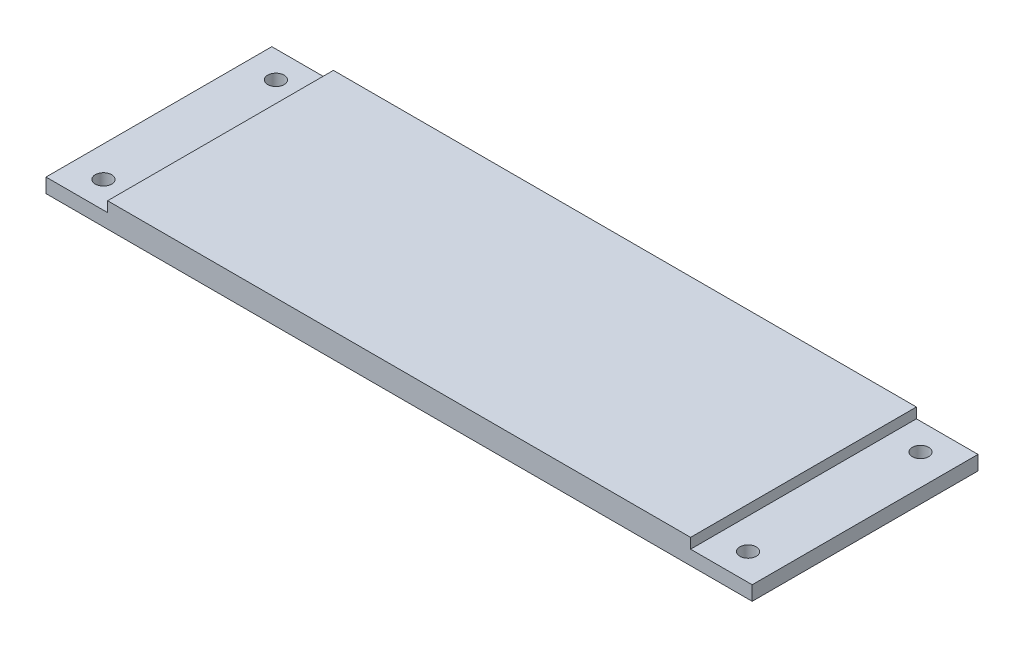
ISO-10303-21;
HEADER;
FILE_DESCRIPTION(('STEP AP214'),'2;1');
FILE_NAME('part.step','',(''),(''),'','','');
FILE_SCHEMA(('AUTOMOTIVE_DESIGN { 1 0 10303 214 1 1 1 1 }'));
ENDSEC;
DATA;
#1=APPLICATION_CONTEXT('core data for automotive mechanical design processes');
#2=APPLICATION_PROTOCOL_DEFINITION('international standard','automotive_design',2000,#1);
#3=PRODUCT_CONTEXT('',#1,'mechanical');
#4=PRODUCT('Part','Part','',(#3));
#5=PRODUCT_RELATED_PRODUCT_CATEGORY('part','',(#4));
#6=PRODUCT_DEFINITION_FORMATION('','',#4);
#7=PRODUCT_DEFINITION_CONTEXT('part definition',#1,'design');
#8=PRODUCT_DEFINITION('design','',#6,#7);
#9=PRODUCT_DEFINITION_SHAPE('','',#8);
#10=(LENGTH_UNIT() NAMED_UNIT(*) SI_UNIT(.MILLI.,.METRE.));
#11=(NAMED_UNIT(*) PLANE_ANGLE_UNIT() SI_UNIT($,.RADIAN.));
#12=(NAMED_UNIT(*) SI_UNIT($,.STERADIAN.) SOLID_ANGLE_UNIT());
#13=UNCERTAINTY_MEASURE_WITH_UNIT(LENGTH_MEASURE(1.E-05),#10,'distance_accuracy_value','');
#14=(GEOMETRIC_REPRESENTATION_CONTEXT(3) GLOBAL_UNCERTAINTY_ASSIGNED_CONTEXT((#13)) GLOBAL_UNIT_ASSIGNED_CONTEXT((#10,
#11,#12)) REPRESENTATION_CONTEXT('',''));
#15=CARTESIAN_POINT('',(0.,0.,0.));
#16=DIRECTION('',(0.,0.,1.));
#17=DIRECTION('',(1.,0.,0.));
#18=AXIS2_PLACEMENT_3D('',#15,#16,#17);
#19=CARTESIAN_POINT('',(0.,3.5,0.));
#20=DIRECTION('',(0.,1.,0.));
#21=DIRECTION('',(0.,0.,1.));
#22=AXIS2_PLACEMENT_3D('',#19,#20,#21);
#23=PLANE('',#22);
#24=DIRECTION('',(0.,0.,1.));
#25=VECTOR('',#24,1.);
#26=CARTESIAN_POINT('',(-71.,3.5,-27.5));
#27=LINE('',#26,#25);
#28=CARTESIAN_POINT('',(-71.,3.5,-27.5));
#29=VERTEX_POINT('',#28);
#30=CARTESIAN_POINT('',(-71.,3.5,27.5));
#31=VERTEX_POINT('',#30);
#32=EDGE_CURVE('E50',#29,#31,#27,.T.);
#33=ORIENTED_EDGE('',*,*,#32,.F.);
#34=DIRECTION('',(-1.,0.,0.));
#35=VECTOR('',#34,1.);
#36=CARTESIAN_POINT('',(-86.,3.5,-27.5));
#37=LINE('',#36,#35);
#38=CARTESIAN_POINT('',(-86.,3.5,-27.5));
#39=VERTEX_POINT('',#38);
#40=EDGE_CURVE('E144',#29,#39,#37,.T.);
#41=ORIENTED_EDGE('',*,*,#40,.T.);
#42=DIRECTION('',(0.,0.,1.));
#43=VECTOR('',#42,1.);
#44=CARTESIAN_POINT('',(-86.,3.5,-27.5));
#45=LINE('',#44,#43);
#46=CARTESIAN_POINT('',(-86.,3.5,27.5));
#47=VERTEX_POINT('',#46);
#48=EDGE_CURVE('E178',#39,#47,#45,.T.);
#49=ORIENTED_EDGE('',*,*,#48,.T.);
#50=DIRECTION('',(1.,0.,0.));
#51=VECTOR('',#50,1.);
#52=CARTESIAN_POINT('',(-86.,3.5,27.5));
#53=LINE('',#52,#51);
#54=EDGE_CURVE('E163',#47,#31,#53,.T.);
#55=ORIENTED_EDGE('',*,*,#54,.T.);
#56=EDGE_LOOP('',(#33,#41,#49,#55));
#57=FACE_BOUND('',#56,.T.);
#58=CARTESIAN_POINT('',(-78.5,3.5,-21.));
#59=DIRECTION('',(0.,1.,0.));
#60=DIRECTION('',(0.,0.,1.));
#61=AXIS2_PLACEMENT_3D('',#58,#59,#60);
#62=CIRCLE('',#61,2.);
#63=CARTESIAN_POINT('',(-78.5,3.5,-19.));
#64=VERTEX_POINT('',#63);
#65=EDGE_CURVE('E190',#64,#64,#62,.T.);
#66=ORIENTED_EDGE('',*,*,#65,.F.);
#67=EDGE_LOOP('',(#66));
#68=FACE_BOUND('',#67,.T.);
#69=CARTESIAN_POINT('',(-78.5,3.5,21.));
#70=DIRECTION('',(0.,1.,0.));
#71=DIRECTION('',(0.,0.,1.));
#72=AXIS2_PLACEMENT_3D('',#69,#70,#71);
#73=CIRCLE('',#72,2.);
#74=CARTESIAN_POINT('',(-78.5,3.5,23.));
#75=VERTEX_POINT('',#74);
#76=EDGE_CURVE('E186',#75,#75,#73,.T.);
#77=ORIENTED_EDGE('',*,*,#76,.F.);
#78=EDGE_LOOP('',(#77));
#79=FACE_BOUND('',#78,.T.);
#80=ADVANCED_FACE('F33',(#57,#68,#79),#23,.T.);
#81=CARTESIAN_POINT('',(-86.,3.5,-27.5));
#82=DIRECTION('',(1.,0.,0.));
#83=DIRECTION('',(0.,0.,-1.));
#84=AXIS2_PLACEMENT_3D('',#81,#82,#83);
#85=PLANE('',#84);
#86=DIRECTION('',(0.,0.,1.));
#87=VECTOR('',#86,1.);
#88=CARTESIAN_POINT('',(-86.,0.,-27.5));
#89=LINE('',#88,#87);
#90=CARTESIAN_POINT('',(-86.,0.,-27.5));
#91=VERTEX_POINT('',#90);
#92=CARTESIAN_POINT('',(-86.,0.,27.5));
#93=VERTEX_POINT('',#92);
#94=EDGE_CURVE('E174',#91,#93,#89,.T.);
#95=ORIENTED_EDGE('',*,*,#94,.T.);
#96=DIRECTION('',(0.,-1.,0.));
#97=VECTOR('',#96,1.);
#98=CARTESIAN_POINT('',(-86.,3.5,27.5));
#99=LINE('',#98,#97);
#100=EDGE_CURVE('E11',#47,#93,#99,.T.);
#101=ORIENTED_EDGE('',*,*,#100,.F.);
#102=ORIENTED_EDGE('',*,*,#48,.F.);
#103=DIRECTION('',(0.,-1.,0.));
#104=VECTOR('',#103,1.);
#105=CARTESIAN_POINT('',(-86.,3.5,-27.5));
#106=LINE('',#105,#104);
#107=EDGE_CURVE('E158',#39,#91,#106,.T.);
#108=ORIENTED_EDGE('',*,*,#107,.T.);
#109=EDGE_LOOP('',(#95,#101,#102,#108));
#110=FACE_BOUND('',#109,.T.);
#111=ADVANCED_FACE('F35',(#110),#85,.F.);
#112=CARTESIAN_POINT('',(-86.,3.5,27.5));
#113=DIRECTION('',(0.,0.,-1.));
#114=DIRECTION('',(-1.,0.,0.));
#115=AXIS2_PLACEMENT_3D('',#112,#113,#114);
#116=PLANE('',#115);
#117=DIRECTION('',(1.,0.,0.));
#118=VECTOR('',#117,1.);
#119=CARTESIAN_POINT('',(-86.,0.,27.5));
#120=LINE('',#119,#118);
#121=CARTESIAN_POINT('',(86.,0.,27.5));
#122=VERTEX_POINT('',#121);
#123=EDGE_CURVE('E203',#93,#122,#120,.T.);
#124=ORIENTED_EDGE('',*,*,#123,.T.);
#125=DIRECTION('',(0.,-1.,0.));
#126=VECTOR('',#125,1.);
#127=CARTESIAN_POINT('',(86.,3.5,27.5));
#128=LINE('',#127,#126);
#129=CARTESIAN_POINT('',(86.,3.5,27.5));
#130=VERTEX_POINT('',#129);
#131=EDGE_CURVE('E42',#130,#122,#128,.T.);
#132=ORIENTED_EDGE('',*,*,#131,.F.);
#133=CARTESIAN_POINT('',(71.,3.5,27.5));
#134=VERTEX_POINT('',#133);
#135=EDGE_CURVE('E167',#134,#130,#53,.T.);
#136=ORIENTED_EDGE('',*,*,#135,.F.);
#137=DIRECTION('',(0.,-1.,0.));
#138=VECTOR('',#137,1.);
#139=CARTESIAN_POINT('',(71.,6.,27.5));
#140=LINE('',#139,#138);
#141=CARTESIAN_POINT('',(71.,6.,27.5));
#142=VERTEX_POINT('',#141);
#143=EDGE_CURVE('E106',#142,#134,#140,.T.);
#144=ORIENTED_EDGE('',*,*,#143,.F.);
#145=DIRECTION('',(1.,0.,0.));
#146=VECTOR('',#145,1.);
#147=CARTESIAN_POINT('',(-71.,6.,27.5));
#148=LINE('',#147,#146);
#149=CARTESIAN_POINT('',(-71.,6.,27.5));
#150=VERTEX_POINT('',#149);
#151=EDGE_CURVE('E100',#150,#142,#148,.T.);
#152=ORIENTED_EDGE('',*,*,#151,.F.);
#153=DIRECTION('',(0.,-1.,0.));
#154=VECTOR('',#153,1.);
#155=CARTESIAN_POINT('',(-71.,6.,27.5));
#156=LINE('',#155,#154);
#157=EDGE_CURVE('E104',#150,#31,#156,.T.);
#158=ORIENTED_EDGE('',*,*,#157,.T.);
#159=ORIENTED_EDGE('',*,*,#54,.F.);
#160=ORIENTED_EDGE('',*,*,#100,.T.);
#161=EDGE_LOOP('',(#124,#132,#136,#144,#152,#158,#159,#160));
#162=FACE_BOUND('',#161,.T.);
#163=ADVANCED_FACE('F102',(#162),#116,.F.);
#164=CARTESIAN_POINT('',(86.,3.5,-27.5));
#165=DIRECTION('',(-1.,0.,0.));
#166=DIRECTION('',(0.,0.,1.));
#167=AXIS2_PLACEMENT_3D('',#164,#165,#166);
#168=PLANE('',#167);
#169=DIRECTION('',(0.,0.,-1.));
#170=VECTOR('',#169,1.);
#171=CARTESIAN_POINT('',(86.,0.,-27.5));
#172=LINE('',#171,#170);
#173=CARTESIAN_POINT('',(86.,0.,-27.5));
#174=VERTEX_POINT('',#173);
#175=EDGE_CURVE('E202',#122,#174,#172,.T.);
#176=ORIENTED_EDGE('',*,*,#175,.T.);
#177=DIRECTION('',(0.,-1.,0.));
#178=VECTOR('',#177,1.);
#179=CARTESIAN_POINT('',(86.,3.5,-27.5));
#180=LINE('',#179,#178);
#181=CARTESIAN_POINT('',(86.,3.5,-27.5));
#182=VERTEX_POINT('',#181);
#183=EDGE_CURVE('E196',#182,#174,#180,.T.);
#184=ORIENTED_EDGE('',*,*,#183,.F.);
#185=DIRECTION('',(0.,0.,-1.));
#186=VECTOR('',#185,1.);
#187=CARTESIAN_POINT('',(86.,3.5,-27.5));
#188=LINE('',#187,#186);
#189=EDGE_CURVE('E162',#130,#182,#188,.T.);
#190=ORIENTED_EDGE('',*,*,#189,.F.);
#191=ORIENTED_EDGE('',*,*,#131,.T.);
#192=EDGE_LOOP('',(#176,#184,#190,#191));
#193=FACE_BOUND('',#192,.T.);
#194=ADVANCED_FACE('F234',(#193),#168,.F.);
#195=CARTESIAN_POINT('',(-86.,3.5,-27.5));
#196=DIRECTION('',(0.,0.,1.));
#197=DIRECTION('',(1.,0.,0.));
#198=AXIS2_PLACEMENT_3D('',#195,#196,#197);
#199=PLANE('',#198);
#200=DIRECTION('',(-1.,0.,0.));
#201=VECTOR('',#200,1.);
#202=CARTESIAN_POINT('',(-86.,0.,-27.5));
#203=LINE('',#202,#201);
#204=EDGE_CURVE('E200',#174,#91,#203,.T.);
#205=ORIENTED_EDGE('',*,*,#204,.T.);
#206=ORIENTED_EDGE('',*,*,#107,.F.);
#207=ORIENTED_EDGE('',*,*,#40,.F.);
#208=DIRECTION('',(0.,-1.,0.));
#209=VECTOR('',#208,1.);
#210=CARTESIAN_POINT('',(-71.,6.,-27.5));
#211=LINE('',#210,#209);
#212=CARTESIAN_POINT('',(-71.,6.,-27.5));
#213=VERTEX_POINT('',#212);
#214=EDGE_CURVE('E134',#213,#29,#211,.T.);
#215=ORIENTED_EDGE('',*,*,#214,.F.);
#216=DIRECTION('',(-1.,0.,0.));
#217=VECTOR('',#216,1.);
#218=CARTESIAN_POINT('',(-71.,6.,-27.5));
#219=LINE('',#218,#217);
#220=CARTESIAN_POINT('',(71.,6.,-27.5));
#221=VERTEX_POINT('',#220);
#222=EDGE_CURVE('E115',#221,#213,#219,.T.);
#223=ORIENTED_EDGE('',*,*,#222,.F.);
#224=DIRECTION('',(0.,-1.,0.));
#225=VECTOR('',#224,1.);
#226=CARTESIAN_POINT('',(71.,6.,-27.5));
#227=LINE('',#226,#225);
#228=CARTESIAN_POINT('',(71.,3.5,-27.5));
#229=VERTEX_POINT('',#228);
#230=EDGE_CURVE('E126',#221,#229,#227,.T.);
#231=ORIENTED_EDGE('',*,*,#230,.T.);
#232=EDGE_CURVE('E161',#182,#229,#37,.T.);
#233=ORIENTED_EDGE('',*,*,#232,.F.);
#234=ORIENTED_EDGE('',*,*,#183,.T.);
#235=EDGE_LOOP('',(#205,#206,#207,#215,#223,#231,#233,#234));
#236=FACE_BOUND('',#235,.T.);
#237=ADVANCED_FACE('F155',(#236),#199,.F.);
#238=DIRECTION('',(0.,0.,-1.));
#239=VECTOR('',#238,1.);
#240=CARTESIAN_POINT('',(71.,3.5,-27.5));
#241=LINE('',#240,#239);
#242=EDGE_CURVE('E58',#134,#229,#241,.T.);
#243=ORIENTED_EDGE('',*,*,#242,.F.);
#244=ORIENTED_EDGE('',*,*,#135,.T.);
#245=ORIENTED_EDGE('',*,*,#189,.T.);
#246=ORIENTED_EDGE('',*,*,#232,.T.);
#247=EDGE_LOOP('',(#243,#244,#245,#246));
#248=FACE_BOUND('',#247,.T.);
#249=CARTESIAN_POINT('',(78.5,3.5,-21.));
#250=DIRECTION('',(0.,1.,0.));
#251=DIRECTION('',(0.,0.,-1.));
#252=AXIS2_PLACEMENT_3D('',#249,#250,#251);
#253=CIRCLE('',#252,2.);
#254=CARTESIAN_POINT('',(78.5,3.5,-23.));
#255=VERTEX_POINT('',#254);
#256=EDGE_CURVE('E121',#255,#255,#253,.T.);
#257=ORIENTED_EDGE('',*,*,#256,.F.);
#258=EDGE_LOOP('',(#257));
#259=FACE_BOUND('',#258,.T.);
#260=CARTESIAN_POINT('',(78.5,3.5,20.9999999999999));
#261=DIRECTION('',(0.,1.,0.));
#262=DIRECTION('',(0.,0.,-1.));
#263=AXIS2_PLACEMENT_3D('',#260,#261,#262);
#264=CIRCLE('',#263,2.);
#265=CARTESIAN_POINT('',(78.5,3.5,18.9999999999999));
#266=VERTEX_POINT('',#265);
#267=EDGE_CURVE('E182',#266,#266,#264,.T.);
#268=ORIENTED_EDGE('',*,*,#267,.F.);
#269=EDGE_LOOP('',(#268));
#270=FACE_BOUND('',#269,.T.);
#271=ADVANCED_FACE('F224',(#248,#259,#270),#23,.T.);
#272=CARTESIAN_POINT('',(0.,0.,0.));
#273=DIRECTION('',(0.,1.,0.));
#274=DIRECTION('',(0.,0.,1.));
#275=AXIS2_PLACEMENT_3D('',#272,#273,#274);
#276=PLANE('',#275);
#277=CARTESIAN_POINT('',(78.5,0.,-21.));
#278=DIRECTION('',(0.,1.,0.));
#279=DIRECTION('',(0.,0.,1.));
#280=AXIS2_PLACEMENT_3D('',#277,#278,#279);
#281=CIRCLE('',#280,2.);
#282=CARTESIAN_POINT('',(78.5,0.,-19.));
#283=VERTEX_POINT('',#282);
#284=EDGE_CURVE('E124',#283,#283,#281,.T.);
#285=ORIENTED_EDGE('',*,*,#284,.T.);
#286=EDGE_LOOP('',(#285));
#287=FACE_BOUND('',#286,.T.);
#288=CARTESIAN_POINT('',(78.5,0.,20.9999999999999));
#289=DIRECTION('',(0.,1.,0.));
#290=DIRECTION('',(0.,0.,1.));
#291=AXIS2_PLACEMENT_3D('',#288,#289,#290);
#292=CIRCLE('',#291,2.);
#293=CARTESIAN_POINT('',(78.5,0.,22.9999999999999));
#294=VERTEX_POINT('',#293);
#295=EDGE_CURVE('E183',#294,#294,#292,.T.);
#296=ORIENTED_EDGE('',*,*,#295,.T.);
#297=EDGE_LOOP('',(#296));
#298=FACE_BOUND('',#297,.T.);
#299=CARTESIAN_POINT('',(-78.5,0.,21.));
#300=DIRECTION('',(0.,1.,0.));
#301=DIRECTION('',(0.,0.,1.));
#302=AXIS2_PLACEMENT_3D('',#299,#300,#301);
#303=CIRCLE('',#302,2.);
#304=CARTESIAN_POINT('',(-78.5,0.,23.));
#305=VERTEX_POINT('',#304);
#306=EDGE_CURVE('E187',#305,#305,#303,.T.);
#307=ORIENTED_EDGE('',*,*,#306,.T.);
#308=EDGE_LOOP('',(#307));
#309=FACE_BOUND('',#308,.T.);
#310=CARTESIAN_POINT('',(-78.5,0.,-21.));
#311=DIRECTION('',(0.,1.,0.));
#312=DIRECTION('',(0.,0.,1.));
#313=AXIS2_PLACEMENT_3D('',#310,#311,#312);
#314=CIRCLE('',#313,2.);
#315=CARTESIAN_POINT('',(-78.5,0.,-19.));
#316=VERTEX_POINT('',#315);
#317=EDGE_CURVE('E191',#316,#316,#314,.T.);
#318=ORIENTED_EDGE('',*,*,#317,.T.);
#319=EDGE_LOOP('',(#318));
#320=FACE_BOUND('',#319,.T.);
#321=ORIENTED_EDGE('',*,*,#94,.F.);
#322=ORIENTED_EDGE('',*,*,#204,.F.);
#323=ORIENTED_EDGE('',*,*,#175,.F.);
#324=ORIENTED_EDGE('',*,*,#123,.F.);
#325=EDGE_LOOP('',(#321,#322,#323,#324));
#326=FACE_BOUND('',#325,.T.);
#327=ADVANCED_FACE('F211',(#287,#298,#309,#320,#326),#276,.F.);
#328=CARTESIAN_POINT('',(-78.5,-2.5,-21.));
#329=DIRECTION('',(0.,1.,0.));
#330=DIRECTION('',(0.,0.,1.));
#331=AXIS2_PLACEMENT_3D('',#328,#329,#330);
#332=CYLINDRICAL_SURFACE('',#331,2.);
#333=ORIENTED_EDGE('',*,*,#65,.T.);
#334=EDGE_LOOP('',(#333));
#335=FACE_BOUND('',#334,.T.);
#336=ORIENTED_EDGE('',*,*,#317,.F.);
#337=EDGE_LOOP('',(#336));
#338=FACE_BOUND('',#337,.T.);
#339=ADVANCED_FACE('F231',(#335,#338),#332,.F.);
#340=CARTESIAN_POINT('',(-78.5,-2.5,21.));
#341=DIRECTION('',(0.,1.,0.));
#342=DIRECTION('',(0.,0.,1.));
#343=AXIS2_PLACEMENT_3D('',#340,#341,#342);
#344=CYLINDRICAL_SURFACE('',#343,2.);
#345=ORIENTED_EDGE('',*,*,#76,.T.);
#346=EDGE_LOOP('',(#345));
#347=FACE_BOUND('',#346,.T.);
#348=ORIENTED_EDGE('',*,*,#306,.F.);
#349=EDGE_LOOP('',(#348));
#350=FACE_BOUND('',#349,.T.);
#351=ADVANCED_FACE('F300',(#347,#350),#344,.F.);
#352=CARTESIAN_POINT('',(78.5,-2.5,20.9999999999999));
#353=DIRECTION('',(0.,1.,0.));
#354=DIRECTION('',(0.,0.,1.));
#355=AXIS2_PLACEMENT_3D('',#352,#353,#354);
#356=CYLINDRICAL_SURFACE('',#355,2.);
#357=ORIENTED_EDGE('',*,*,#267,.T.);
#358=EDGE_LOOP('',(#357));
#359=FACE_BOUND('',#358,.T.);
#360=ORIENTED_EDGE('',*,*,#295,.F.);
#361=EDGE_LOOP('',(#360));
#362=FACE_BOUND('',#361,.T.);
#363=ADVANCED_FACE('F221',(#359,#362),#356,.F.);
#364=CARTESIAN_POINT('',(78.5,-2.5,-21.));
#365=DIRECTION('',(0.,1.,0.));
#366=DIRECTION('',(0.,0.,1.));
#367=AXIS2_PLACEMENT_3D('',#364,#365,#366);
#368=CYLINDRICAL_SURFACE('',#367,2.);
#369=ORIENTED_EDGE('',*,*,#256,.T.);
#370=EDGE_LOOP('',(#369));
#371=FACE_BOUND('',#370,.T.);
#372=ORIENTED_EDGE('',*,*,#284,.F.);
#373=EDGE_LOOP('',(#372));
#374=FACE_BOUND('',#373,.T.);
#375=ADVANCED_FACE('F274',(#371,#374),#368,.F.);
#376=CARTESIAN_POINT('',(-71.,6.,-27.5));
#377=DIRECTION('',(1.,0.,0.));
#378=DIRECTION('',(0.,0.,-1.));
#379=AXIS2_PLACEMENT_3D('',#376,#377,#378);
#380=PLANE('',#379);
#381=ORIENTED_EDGE('',*,*,#32,.T.);
#382=ORIENTED_EDGE('',*,*,#157,.F.);
#383=DIRECTION('',(0.,0.,1.));
#384=VECTOR('',#383,1.);
#385=CARTESIAN_POINT('',(-71.,6.,-27.5));
#386=LINE('',#385,#384);
#387=EDGE_CURVE('E110',#213,#150,#386,.T.);
#388=ORIENTED_EDGE('',*,*,#387,.F.);
#389=ORIENTED_EDGE('',*,*,#214,.T.);
#390=EDGE_LOOP('',(#381,#382,#388,#389));
#391=FACE_BOUND('',#390,.T.);
#392=ADVANCED_FACE('F120',(#391),#380,.F.);
#393=CARTESIAN_POINT('',(71.,6.,-27.5));
#394=DIRECTION('',(-1.,0.,0.));
#395=DIRECTION('',(0.,0.,1.));
#396=AXIS2_PLACEMENT_3D('',#393,#394,#395);
#397=PLANE('',#396);
#398=ORIENTED_EDGE('',*,*,#242,.T.);
#399=ORIENTED_EDGE('',*,*,#230,.F.);
#400=DIRECTION('',(0.,0.,-1.));
#401=VECTOR('',#400,1.);
#402=CARTESIAN_POINT('',(71.,6.,-27.5));
#403=LINE('',#402,#401);
#404=EDGE_CURVE('E109',#142,#221,#403,.T.);
#405=ORIENTED_EDGE('',*,*,#404,.F.);
#406=ORIENTED_EDGE('',*,*,#143,.T.);
#407=EDGE_LOOP('',(#398,#399,#405,#406));
#408=FACE_BOUND('',#407,.T.);
#409=ADVANCED_FACE('F154',(#408),#397,.F.);
#410=CARTESIAN_POINT('',(0.,6.,0.));
#411=DIRECTION('',(0.,1.,0.));
#412=DIRECTION('',(0.,0.,1.));
#413=AXIS2_PLACEMENT_3D('',#410,#411,#412);
#414=PLANE('',#413);
#415=ORIENTED_EDGE('',*,*,#387,.T.);
#416=ORIENTED_EDGE('',*,*,#151,.T.);
#417=ORIENTED_EDGE('',*,*,#404,.T.);
#418=ORIENTED_EDGE('',*,*,#222,.T.);
#419=EDGE_LOOP('',(#415,#416,#417,#418));
#420=FACE_BOUND('',#419,.T.);
#421=ADVANCED_FACE('F113',(#420),#414,.T.);
#422=CLOSED_SHELL('',(#80,#111,#163,#194,#237,#271,#327,#339,#351,#363,#375,#392,#409,#421));
#423=MANIFOLD_SOLID_BREP('B2',#422);
#424=ADVANCED_BREP_SHAPE_REPRESENTATION('',(#18,#423),#14);
#425=SHAPE_DEFINITION_REPRESENTATION(#9,#424);
ENDSEC;
END-ISO-10303-21;
